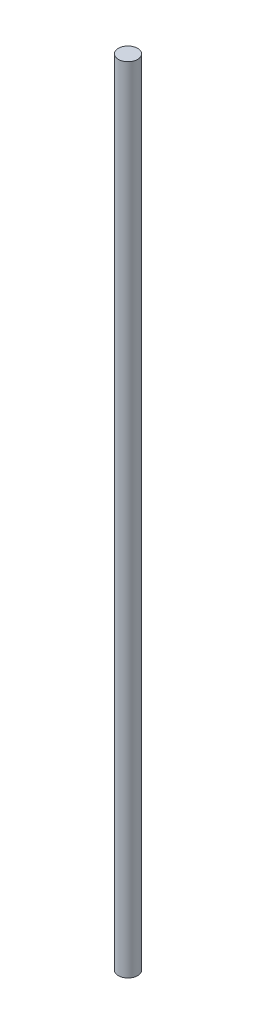
ISO-10303-21;
HEADER;
FILE_DESCRIPTION(('STEP AP214'),'2;1');
FILE_NAME('part.step','',(''),(''),'','','');
FILE_SCHEMA(('AUTOMOTIVE_DESIGN { 1 0 10303 214 1 1 1 1 }'));
ENDSEC;
DATA;
#1=APPLICATION_CONTEXT('core data for automotive mechanical design processes');
#2=APPLICATION_PROTOCOL_DEFINITION('international standard','automotive_design',2000,#1);
#3=PRODUCT_CONTEXT('',#1,'mechanical');
#4=PRODUCT('Part','Part','',(#3));
#5=PRODUCT_RELATED_PRODUCT_CATEGORY('part','',(#4));
#6=PRODUCT_DEFINITION_FORMATION('','',#4);
#7=PRODUCT_DEFINITION_CONTEXT('part definition',#1,'design');
#8=PRODUCT_DEFINITION('design','',#6,#7);
#9=PRODUCT_DEFINITION_SHAPE('','',#8);
#10=(LENGTH_UNIT() NAMED_UNIT(*) SI_UNIT(.MILLI.,.METRE.));
#11=(NAMED_UNIT(*) PLANE_ANGLE_UNIT() SI_UNIT($,.RADIAN.));
#12=(NAMED_UNIT(*) SI_UNIT($,.STERADIAN.) SOLID_ANGLE_UNIT());
#13=UNCERTAINTY_MEASURE_WITH_UNIT(LENGTH_MEASURE(1.E-05),#10,'distance_accuracy_value','');
#14=(GEOMETRIC_REPRESENTATION_CONTEXT(3) GLOBAL_UNCERTAINTY_ASSIGNED_CONTEXT((#13)) GLOBAL_UNIT_ASSIGNED_CONTEXT((#10,
#11,#12)) REPRESENTATION_CONTEXT('',''));
#15=CARTESIAN_POINT('',(0.,0.,0.));
#16=DIRECTION('',(0.,0.,1.));
#17=DIRECTION('',(1.,0.,0.));
#18=AXIS2_PLACEMENT_3D('',#15,#16,#17);
#19=CARTESIAN_POINT('',(0.,330.,0.));
#20=DIRECTION('',(0.,-1.,0.));
#21=DIRECTION('',(0.,0.,-1.));
#22=AXIS2_PLACEMENT_3D('',#19,#20,#21);
#23=CYLINDRICAL_SURFACE('',#22,4.);
#24=CARTESIAN_POINT('',(0.,330.,0.));
#25=DIRECTION('',(0.,1.,0.));
#26=DIRECTION('',(0.,0.,1.));
#27=AXIS2_PLACEMENT_3D('',#24,#25,#26);
#28=CIRCLE('',#27,4.);
#29=CARTESIAN_POINT('',(0.,330.,4.));
#30=VERTEX_POINT('',#29);
#31=EDGE_CURVE('E10',#30,#30,#28,.T.);
#32=ORIENTED_EDGE('',*,*,#31,.F.);
#33=EDGE_LOOP('',(#32));
#34=FACE_BOUND('',#33,.T.);
#35=CARTESIAN_POINT('',(0.,0.,0.));
#36=DIRECTION('',(0.,1.,0.));
#37=DIRECTION('',(0.,0.,1.));
#38=AXIS2_PLACEMENT_3D('',#35,#36,#37);
#39=CIRCLE('',#38,4.);
#40=CARTESIAN_POINT('',(0.,0.,4.));
#41=VERTEX_POINT('',#40);
#42=EDGE_CURVE('E33',#41,#41,#39,.T.);
#43=ORIENTED_EDGE('',*,*,#42,.T.);
#44=EDGE_LOOP('',(#43));
#45=FACE_BOUND('',#44,.T.);
#46=ADVANCED_FACE('F30',(#34,#45),#23,.T.);
#47=CARTESIAN_POINT('',(0.,330.,0.));
#48=DIRECTION('',(0.,1.,0.));
#49=DIRECTION('',(0.,0.,1.));
#50=AXIS2_PLACEMENT_3D('',#47,#48,#49);
#51=PLANE('',#50);
#52=ORIENTED_EDGE('',*,*,#31,.T.);
#53=EDGE_LOOP('',(#52));
#54=FACE_BOUND('',#53,.T.);
#55=ADVANCED_FACE('F45',(#54),#51,.T.);
#56=CARTESIAN_POINT('',(0.,0.,0.));
#57=DIRECTION('',(0.,1.,0.));
#58=DIRECTION('',(0.,0.,1.));
#59=AXIS2_PLACEMENT_3D('',#56,#57,#58);
#60=PLANE('',#59);
#61=ORIENTED_EDGE('',*,*,#42,.F.);
#62=EDGE_LOOP('',(#61));
#63=FACE_BOUND('',#62,.T.);
#64=ADVANCED_FACE('F43',(#63),#60,.F.);
#65=CLOSED_SHELL('',(#46,#55,#64));
#66=MANIFOLD_SOLID_BREP('B2',#65);
#67=ADVANCED_BREP_SHAPE_REPRESENTATION('',(#18,#66),#14);
#68=SHAPE_DEFINITION_REPRESENTATION(#9,#67);
ENDSEC;
END-ISO-10303-21;
